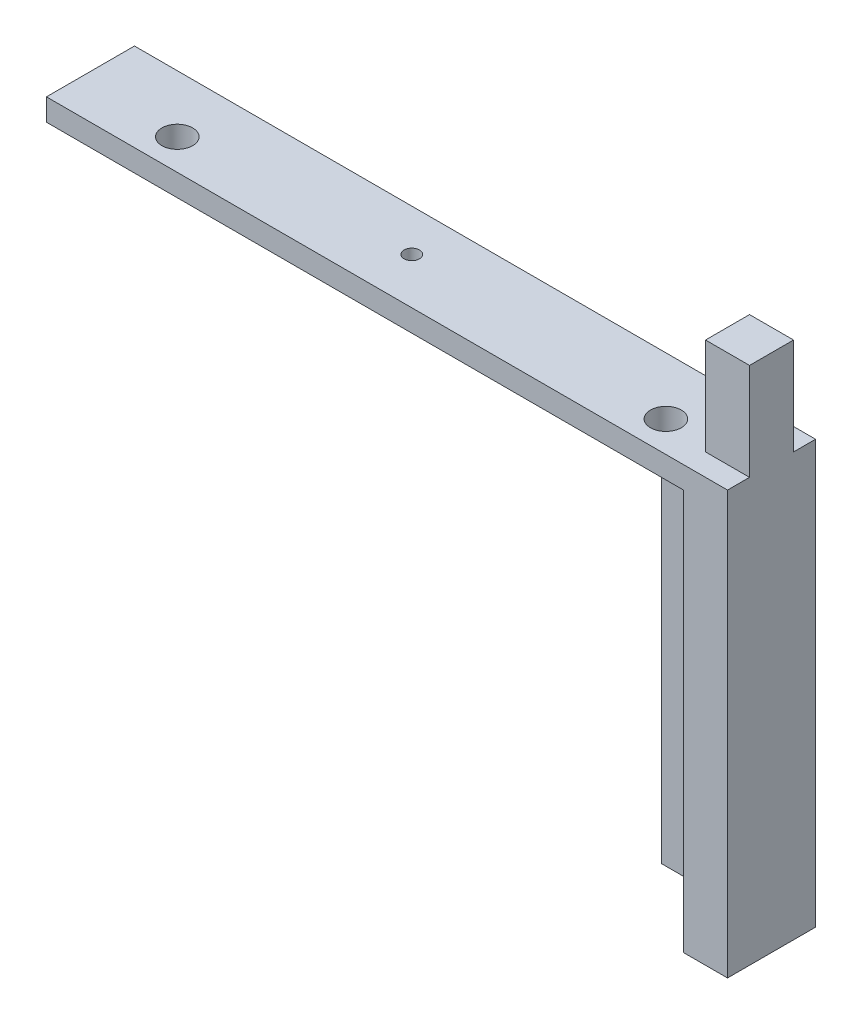
ISO-10303-21;
HEADER;
FILE_DESCRIPTION(('STEP AP214'),'2;1');
FILE_NAME('part.step','',(''),(''),'','','');
FILE_SCHEMA(('AUTOMOTIVE_DESIGN { 1 0 10303 214 1 1 1 1 }'));
ENDSEC;
DATA;
#1=APPLICATION_CONTEXT('core data for automotive mechanical design processes');
#2=APPLICATION_PROTOCOL_DEFINITION('international standard','automotive_design',2000,#1);
#3=PRODUCT_CONTEXT('',#1,'mechanical');
#4=PRODUCT('Part','Part','',(#3));
#5=PRODUCT_RELATED_PRODUCT_CATEGORY('part','',(#4));
#6=PRODUCT_DEFINITION_FORMATION('','',#4);
#7=PRODUCT_DEFINITION_CONTEXT('part definition',#1,'design');
#8=PRODUCT_DEFINITION('design','',#6,#7);
#9=PRODUCT_DEFINITION_SHAPE('','',#8);
#10=(LENGTH_UNIT() NAMED_UNIT(*) SI_UNIT(.MILLI.,.METRE.));
#11=(NAMED_UNIT(*) PLANE_ANGLE_UNIT() SI_UNIT($,.RADIAN.));
#12=(NAMED_UNIT(*) SI_UNIT($,.STERADIAN.) SOLID_ANGLE_UNIT());
#13=UNCERTAINTY_MEASURE_WITH_UNIT(LENGTH_MEASURE(1.E-05),#10,'distance_accuracy_value','');
#14=(GEOMETRIC_REPRESENTATION_CONTEXT(3) GLOBAL_UNCERTAINTY_ASSIGNED_CONTEXT((#13)) GLOBAL_UNIT_ASSIGNED_CONTEXT((#10,
#11,#12)) REPRESENTATION_CONTEXT('',''));
#15=CARTESIAN_POINT('',(0.,0.,0.));
#16=DIRECTION('',(0.,0.,1.));
#17=DIRECTION('',(1.,0.,0.));
#18=AXIS2_PLACEMENT_3D('',#15,#16,#17);
#19=CARTESIAN_POINT('',(0.,0.,10.));
#20=DIRECTION('',(1.,0.,0.));
#21=DIRECTION('',(0.,1.,0.));
#22=AXIS2_PLACEMENT_3D('',#19,#20,#21);
#23=PLANE('',#22);
#24=DIRECTION('',(0.,0.,1.));
#25=VECTOR('',#24,1.);
#26=CARTESIAN_POINT('',(0.,-9.31900447361045,0.));
#27=LINE('',#26,#25);
#28=CARTESIAN_POINT('',(0.,-9.31900447361045,-5.));
#29=VERTEX_POINT('',#28);
#30=CARTESIAN_POINT('',(0.,-9.31900447361045,0.));
#31=VERTEX_POINT('',#30);
#32=EDGE_CURVE('E58',#29,#31,#27,.T.);
#33=ORIENTED_EDGE('',*,*,#32,.F.);
#34=DIRECTION('',(0.,1.,0.));
#35=VECTOR('',#34,1.);
#36=CARTESIAN_POINT('',(0.,0.,-5.));
#37=LINE('',#36,#35);
#38=CARTESIAN_POINT('',(0.,-95.9999999999999,-5.00000000000001));
#39=VERTEX_POINT('',#38);
#40=EDGE_CURVE('E161',#39,#29,#37,.T.);
#41=ORIENTED_EDGE('',*,*,#40,.F.);
#42=DIRECTION('',(0.,0.,-1.));
#43=VECTOR('',#42,1.);
#44=CARTESIAN_POINT('',(0.,-95.9999999999999,0.));
#45=LINE('',#44,#43);
#46=CARTESIAN_POINT('',(0.,-95.9999999999999,0.));
#47=VERTEX_POINT('',#46);
#48=EDGE_CURVE('E162',#47,#39,#45,.T.);
#49=ORIENTED_EDGE('',*,*,#48,.F.);
#50=DIRECTION('',(0.,1.,0.));
#51=VECTOR('',#50,1.);
#52=CARTESIAN_POINT('',(0.,0.,0.));
#53=LINE('',#52,#51);
#54=EDGE_CURVE('E197',#47,#31,#53,.T.);
#55=ORIENTED_EDGE('',*,*,#54,.T.);
#56=EDGE_LOOP('',(#33,#41,#49,#55));
#57=FACE_BOUND('',#56,.T.);
#58=ADVANCED_FACE('F41',(#57),#23,.F.);
#59=CARTESIAN_POINT('',(0.,0.,0.));
#60=DIRECTION('',(0.,0.,1.));
#61=DIRECTION('',(1.,0.,0.));
#62=AXIS2_PLACEMENT_3D('',#59,#60,#61);
#63=PLANE('',#62);
#64=DIRECTION('',(1.,0.,0.));
#65=VECTOR('',#64,1.);
#66=CARTESIAN_POINT('',(0.,0.,0.));
#67=LINE('',#66,#65);
#68=CARTESIAN_POINT('',(20.,0.,0.));
#69=VERTEX_POINT('',#68);
#70=CARTESIAN_POINT('',(30.,0.,0.));
#71=VERTEX_POINT('',#70);
#72=EDGE_CURVE('E11',#69,#71,#67,.T.);
#73=ORIENTED_EDGE('',*,*,#72,.F.);
#74=DIRECTION('',(0.,-1.,0.));
#75=VECTOR('',#74,1.);
#76=CARTESIAN_POINT('',(20.,0.,0.));
#77=LINE('',#76,#75);
#78=CARTESIAN_POINT('',(20.,22.02,0.));
#79=VERTEX_POINT('',#78);
#80=EDGE_CURVE('E211',#79,#69,#77,.T.);
#81=ORIENTED_EDGE('',*,*,#80,.F.);
#82=DIRECTION('',(-1.,0.,0.));
#83=VECTOR('',#82,1.);
#84=CARTESIAN_POINT('',(20.,22.02,0.));
#85=LINE('',#84,#83);
#86=CARTESIAN_POINT('',(30.,22.02,0.));
#87=VERTEX_POINT('',#86);
#88=EDGE_CURVE('E221',#87,#79,#85,.T.);
#89=ORIENTED_EDGE('',*,*,#88,.F.);
#90=DIRECTION('',(0.,1.,0.));
#91=VECTOR('',#90,1.);
#92=CARTESIAN_POINT('',(30.,22.02,0.));
#93=LINE('',#92,#91);
#94=EDGE_CURVE('E219',#71,#87,#93,.T.);
#95=ORIENTED_EDGE('',*,*,#94,.F.);
#96=EDGE_LOOP('',(#73,#81,#89,#95));
#97=FACE_BOUND('',#96,.T.);
#98=ADVANCED_FACE('F294',(#97),#63,.F.);
#99=CARTESIAN_POINT('',(0.,0.,10.));
#100=DIRECTION('',(0.,-1.,0.));
#101=DIRECTION('',(0.,0.,-1.));
#102=AXIS2_PLACEMENT_3D('',#99,#100,#101);
#103=PLANE('',#102);
#104=CARTESIAN_POINT('',(9.00000000000002,0.,8.00000000000001));
#105=DIRECTION('',(0.,-1.,0.));
#106=DIRECTION('',(0.,0.,-1.));
#107=AXIS2_PLACEMENT_3D('',#104,#105,#106);
#108=CIRCLE('',#107,3.4999999999998);
#109=CARTESIAN_POINT('',(9.00000000000002,0.,4.50000000000021));
#110=VERTEX_POINT('',#109);
#111=EDGE_CURVE('E241',#110,#110,#108,.F.);
#112=ORIENTED_EDGE('',*,*,#111,.F.);
#113=EDGE_LOOP('',(#112));
#114=FACE_BOUND('',#113,.T.);
#115=CARTESIAN_POINT('',(-102.,0.,8.00000000000001));
#116=DIRECTION('',(0.,-1.,0.));
#117=DIRECTION('',(0.,0.,-1.));
#118=AXIS2_PLACEMENT_3D('',#115,#116,#117);
#119=CIRCLE('',#118,3.50000000000001);
#120=CARTESIAN_POINT('',(-102.,0.,4.5));
#121=VERTEX_POINT('',#120);
#122=EDGE_CURVE('E238',#121,#121,#119,.F.);
#123=ORIENTED_EDGE('',*,*,#122,.F.);
#124=EDGE_LOOP('',(#123));
#125=FACE_BOUND('',#124,.T.);
#126=CARTESIAN_POINT('',(-52.2204706117234,0.,4.50093124375004));
#127=DIRECTION('',(0.,-1.,0.));
#128=DIRECTION('',(0.,0.,-1.));
#129=AXIS2_PLACEMENT_3D('',#126,#127,#128);
#130=CIRCLE('',#129,1.75);
#131=CARTESIAN_POINT('',(-52.2204706117234,0.,2.75093124375003));
#132=VERTEX_POINT('',#131);
#133=EDGE_CURVE('E237',#132,#132,#130,.F.);
#134=ORIENTED_EDGE('',*,*,#133,.F.);
#135=EDGE_LOOP('',(#134));
#136=FACE_BOUND('',#135,.T.);
#137=DIRECTION('',(0.,0.,-1.));
#138=VECTOR('',#137,1.);
#139=CARTESIAN_POINT('',(20.,0.,10.));
#140=LINE('',#139,#138);
#141=CARTESIAN_POINT('',(20.,0.,10.));
#142=VERTEX_POINT('',#141);
#143=EDGE_CURVE('E215',#142,#69,#140,.T.);
#144=ORIENTED_EDGE('',*,*,#143,.T.);
#145=ORIENTED_EDGE('',*,*,#72,.T.);
#146=DIRECTION('',(0.,0.,1.));
#147=VECTOR('',#146,1.);
#148=CARTESIAN_POINT('',(30.,0.,-5.));
#149=LINE('',#148,#147);
#150=CARTESIAN_POINT('',(30.,0.,-5.));
#151=VERTEX_POINT('',#150);
#152=EDGE_CURVE('E203',#151,#71,#149,.T.);
#153=ORIENTED_EDGE('',*,*,#152,.F.);
#154=DIRECTION('',(1.,0.,0.));
#155=VECTOR('',#154,1.);
#156=CARTESIAN_POINT('',(0.,0.,-5.));
#157=LINE('',#156,#155);
#158=CARTESIAN_POINT('',(-124.720470611723,0.,-5.));
#159=VERTEX_POINT('',#158);
#160=EDGE_CURVE('E199',#159,#151,#157,.T.);
#161=ORIENTED_EDGE('',*,*,#160,.F.);
#162=DIRECTION('',(0.,0.,-1.));
#163=VECTOR('',#162,1.);
#164=CARTESIAN_POINT('',(-124.720470611723,0.,0.));
#165=LINE('',#164,#163);
#166=CARTESIAN_POINT('',(-124.720470611723,0.,15.));
#167=VERTEX_POINT('',#166);
#168=EDGE_CURVE('E156',#167,#159,#165,.T.);
#169=ORIENTED_EDGE('',*,*,#168,.F.);
#170=DIRECTION('',(-1.,0.,0.));
#171=VECTOR('',#170,1.);
#172=CARTESIAN_POINT('',(30.,0.,15.));
#173=LINE('',#172,#171);
#174=CARTESIAN_POINT('',(30.,0.,15.));
#175=VERTEX_POINT('',#174);
#176=EDGE_CURVE('E184',#175,#167,#173,.T.);
#177=ORIENTED_EDGE('',*,*,#176,.F.);
#178=DIRECTION('',(0.,0.,-1.));
#179=VECTOR('',#178,1.);
#180=CARTESIAN_POINT('',(30.,0.,15.));
#181=LINE('',#180,#179);
#182=CARTESIAN_POINT('',(30.,0.,10.));
#183=VERTEX_POINT('',#182);
#184=EDGE_CURVE('E193',#175,#183,#181,.T.);
#185=ORIENTED_EDGE('',*,*,#184,.T.);
#186=DIRECTION('',(-1.,0.,0.));
#187=VECTOR('',#186,1.);
#188=CARTESIAN_POINT('',(30.,0.,10.));
#189=LINE('',#188,#187);
#190=EDGE_CURVE('E66',#183,#142,#189,.T.);
#191=ORIENTED_EDGE('',*,*,#190,.T.);
#192=EDGE_LOOP('',(#144,#145,#153,#161,#169,#177,#185,#191));
#193=FACE_BOUND('',#192,.T.);
#194=ADVANCED_FACE('F43',(#114,#125,#136,#193),#103,.F.);
#195=CARTESIAN_POINT('',(0.,-5.,10.));
#196=DIRECTION('',(0.,1.,0.));
#197=DIRECTION('',(0.,0.,1.));
#198=AXIS2_PLACEMENT_3D('',#195,#196,#197);
#199=PLANE('',#198);
#200=CARTESIAN_POINT('',(9.00000000000002,-5.,8.00000000000001));
#201=DIRECTION('',(0.,1.,0.));
#202=DIRECTION('',(0.,0.,1.));
#203=AXIS2_PLACEMENT_3D('',#200,#201,#202);
#204=CIRCLE('',#203,3.4999999999998);
#205=CARTESIAN_POINT('',(9.00000000000002,-5.,11.4999999999998));
#206=VERTEX_POINT('',#205);
#207=EDGE_CURVE('E45',#206,#206,#204,.F.);
#208=ORIENTED_EDGE('',*,*,#207,.F.);
#209=EDGE_LOOP('',(#208));
#210=FACE_BOUND('',#209,.T.);
#211=CARTESIAN_POINT('',(-102.,-5.,8.00000000000001));
#212=DIRECTION('',(0.,1.,0.));
#213=DIRECTION('',(0.,0.,1.));
#214=AXIS2_PLACEMENT_3D('',#211,#212,#213);
#215=CIRCLE('',#214,3.50000000000001);
#216=CARTESIAN_POINT('',(-102.,-5.,11.5));
#217=VERTEX_POINT('',#216);
#218=EDGE_CURVE('E239',#217,#217,#215,.F.);
#219=ORIENTED_EDGE('',*,*,#218,.F.);
#220=EDGE_LOOP('',(#219));
#221=FACE_BOUND('',#220,.T.);
#222=CARTESIAN_POINT('',(-52.2204706117234,-5.,4.50093124375004));
#223=DIRECTION('',(0.,1.,0.));
#224=DIRECTION('',(0.,0.,1.));
#225=AXIS2_PLACEMENT_3D('',#222,#223,#224);
#226=CIRCLE('',#225,1.75);
#227=CARTESIAN_POINT('',(-52.2204706117234,-5.,6.25093124375004));
#228=VERTEX_POINT('',#227);
#229=EDGE_CURVE('E235',#228,#228,#226,.F.);
#230=ORIENTED_EDGE('',*,*,#229,.F.);
#231=EDGE_LOOP('',(#230));
#232=FACE_BOUND('',#231,.T.);
#233=DIRECTION('',(1.,0.,0.));
#234=VECTOR('',#233,1.);
#235=CARTESIAN_POINT('',(0.,-5.,0.));
#236=LINE('',#235,#234);
#237=CARTESIAN_POINT('',(-124.720470611723,-5.00000000000002,0.));
#238=VERTEX_POINT('',#237);
#239=CARTESIAN_POINT('',(20.,-5.,0.));
#240=VERTEX_POINT('',#239);
#241=EDGE_CURVE('E207',#238,#240,#236,.T.);
#242=ORIENTED_EDGE('',*,*,#241,.T.);
#243=DIRECTION('',(0.,0.,-1.));
#244=VECTOR('',#243,1.);
#245=CARTESIAN_POINT('',(20.,-5.,10.));
#246=LINE('',#245,#244);
#247=CARTESIAN_POINT('',(20.,-5.,15.));
#248=VERTEX_POINT('',#247);
#249=EDGE_CURVE('E50',#248,#240,#246,.T.);
#250=ORIENTED_EDGE('',*,*,#249,.F.);
#251=DIRECTION('',(1.,0.,0.));
#252=VECTOR('',#251,1.);
#253=CARTESIAN_POINT('',(0.,-5.,15.));
#254=LINE('',#253,#252);
#255=CARTESIAN_POINT('',(-124.720470611723,-5.00000000000002,15.));
#256=VERTEX_POINT('',#255);
#257=EDGE_CURVE('E186',#256,#248,#254,.T.);
#258=ORIENTED_EDGE('',*,*,#257,.F.);
#259=DIRECTION('',(0.,0.,1.));
#260=VECTOR('',#259,1.);
#261=CARTESIAN_POINT('',(-124.720470611723,-5.00000000000002,0.));
#262=LINE('',#261,#260);
#263=EDGE_CURVE('E261',#238,#256,#262,.T.);
#264=ORIENTED_EDGE('',*,*,#263,.F.);
#265=EDGE_LOOP('',(#242,#250,#258,#264));
#266=FACE_BOUND('',#265,.T.);
#267=ADVANCED_FACE('F273',(#210,#221,#232,#266),#199,.F.);
#268=CARTESIAN_POINT('',(20.,-5.,10.));
#269=DIRECTION('',(1.,0.,0.));
#270=DIRECTION('',(0.,0.,-1.));
#271=AXIS2_PLACEMENT_3D('',#268,#269,#270);
#272=PLANE('',#271);
#273=DIRECTION('',(0.,-1.,0.));
#274=VECTOR('',#273,1.);
#275=CARTESIAN_POINT('',(20.,-5.,0.));
#276=LINE('',#275,#274);
#277=CARTESIAN_POINT('',(20.,-95.9999999999999,0.));
#278=VERTEX_POINT('',#277);
#279=EDGE_CURVE('E217',#240,#278,#276,.T.);
#280=ORIENTED_EDGE('',*,*,#279,.T.);
#281=DIRECTION('',(0.,0.,-1.));
#282=VECTOR('',#281,1.);
#283=CARTESIAN_POINT('',(20.,-95.9999999999999,15.));
#284=LINE('',#283,#282);
#285=CARTESIAN_POINT('',(20.,-95.9999999999999,15.));
#286=VERTEX_POINT('',#285);
#287=EDGE_CURVE('E173',#286,#278,#284,.T.);
#288=ORIENTED_EDGE('',*,*,#287,.F.);
#289=DIRECTION('',(0.,-1.,0.));
#290=VECTOR('',#289,1.);
#291=CARTESIAN_POINT('',(20.,-5.,15.));
#292=LINE('',#291,#290);
#293=EDGE_CURVE('E189',#248,#286,#292,.T.);
#294=ORIENTED_EDGE('',*,*,#293,.F.);
#295=ORIENTED_EDGE('',*,*,#249,.T.);
#296=EDGE_LOOP('',(#280,#288,#294,#295));
#297=FACE_BOUND('',#296,.T.);
#298=ADVANCED_FACE('F280',(#297),#272,.F.);
#299=CARTESIAN_POINT('',(30.,22.02,10.));
#300=DIRECTION('',(-1.,0.,0.));
#301=DIRECTION('',(0.,0.,1.));
#302=AXIS2_PLACEMENT_3D('',#299,#300,#301);
#303=PLANE('',#302);
#304=DIRECTION('',(0.,1.,0.));
#305=VECTOR('',#304,1.);
#306=CARTESIAN_POINT('',(30.,-25.,15.));
#307=LINE('',#306,#305);
#308=CARTESIAN_POINT('',(30.,-95.9999999999999,15.));
#309=VERTEX_POINT('',#308);
#310=EDGE_CURVE('E191',#309,#175,#307,.T.);
#311=ORIENTED_EDGE('',*,*,#310,.F.);
#312=DIRECTION('',(0.,0.,1.));
#313=VECTOR('',#312,1.);
#314=CARTESIAN_POINT('',(30.,-95.9999999999999,-5.));
#315=LINE('',#314,#313);
#316=CARTESIAN_POINT('',(30.,-95.9999999999999,-5.));
#317=VERTEX_POINT('',#316);
#318=EDGE_CURVE('E174',#317,#309,#315,.T.);
#319=ORIENTED_EDGE('',*,*,#318,.F.);
#320=DIRECTION('',(0.,-1.,0.));
#321=VECTOR('',#320,1.);
#322=CARTESIAN_POINT('',(30.,0.,-5.));
#323=LINE('',#322,#321);
#324=EDGE_CURVE('E201',#151,#317,#323,.T.);
#325=ORIENTED_EDGE('',*,*,#324,.F.);
#326=ORIENTED_EDGE('',*,*,#152,.T.);
#327=ORIENTED_EDGE('',*,*,#94,.T.);
#328=DIRECTION('',(0.,0.,-1.));
#329=VECTOR('',#328,1.);
#330=CARTESIAN_POINT('',(30.,22.02,10.));
#331=LINE('',#330,#329);
#332=CARTESIAN_POINT('',(30.,22.02,10.));
#333=VERTEX_POINT('',#332);
#334=EDGE_CURVE('E230',#333,#87,#331,.T.);
#335=ORIENTED_EDGE('',*,*,#334,.F.);
#336=DIRECTION('',(0.,1.,0.));
#337=VECTOR('',#336,1.);
#338=CARTESIAN_POINT('',(30.,22.02,10.));
#339=LINE('',#338,#337);
#340=EDGE_CURVE('E208',#183,#333,#339,.T.);
#341=ORIENTED_EDGE('',*,*,#340,.F.);
#342=ORIENTED_EDGE('',*,*,#184,.F.);
#343=EDGE_LOOP('',(#311,#319,#325,#326,#327,#335,#341,#342));
#344=FACE_BOUND('',#343,.T.);
#345=ADVANCED_FACE('F288',(#344),#303,.F.);
#346=CARTESIAN_POINT('',(20.,22.02,10.));
#347=DIRECTION('',(0.,-1.,0.));
#348=DIRECTION('',(0.,0.,-1.));
#349=AXIS2_PLACEMENT_3D('',#346,#347,#348);
#350=PLANE('',#349);
#351=ORIENTED_EDGE('',*,*,#88,.T.);
#352=DIRECTION('',(0.,0.,-1.));
#353=VECTOR('',#352,1.);
#354=CARTESIAN_POINT('',(20.,22.02,10.));
#355=LINE('',#354,#353);
#356=CARTESIAN_POINT('',(20.,22.02,10.));
#357=VERTEX_POINT('',#356);
#358=EDGE_CURVE('E227',#357,#79,#355,.T.);
#359=ORIENTED_EDGE('',*,*,#358,.F.);
#360=DIRECTION('',(-1.,0.,0.));
#361=VECTOR('',#360,1.);
#362=CARTESIAN_POINT('',(20.,22.02,10.));
#363=LINE('',#362,#361);
#364=EDGE_CURVE('E210',#333,#357,#363,.T.);
#365=ORIENTED_EDGE('',*,*,#364,.F.);
#366=ORIENTED_EDGE('',*,*,#334,.T.);
#367=EDGE_LOOP('',(#351,#359,#365,#366));
#368=FACE_BOUND('',#367,.T.);
#369=ADVANCED_FACE('F310',(#368),#350,.F.);
#370=CARTESIAN_POINT('',(20.,0.,10.));
#371=DIRECTION('',(1.,0.,0.));
#372=DIRECTION('',(0.,0.,-1.));
#373=AXIS2_PLACEMENT_3D('',#370,#371,#372);
#374=PLANE('',#373);
#375=ORIENTED_EDGE('',*,*,#80,.T.);
#376=ORIENTED_EDGE('',*,*,#143,.F.);
#377=DIRECTION('',(0.,-1.,0.));
#378=VECTOR('',#377,1.);
#379=CARTESIAN_POINT('',(20.,0.,10.));
#380=LINE('',#379,#378);
#381=EDGE_CURVE('E213',#357,#142,#380,.T.);
#382=ORIENTED_EDGE('',*,*,#381,.F.);
#383=ORIENTED_EDGE('',*,*,#358,.T.);
#384=EDGE_LOOP('',(#375,#376,#382,#383));
#385=FACE_BOUND('',#384,.T.);
#386=ADVANCED_FACE('F313',(#385),#374,.F.);
#387=CARTESIAN_POINT('',(0.,0.,10.));
#388=DIRECTION('',(0.,0.,1.));
#389=DIRECTION('',(1.,0.,0.));
#390=AXIS2_PLACEMENT_3D('',#387,#388,#389);
#391=PLANE('',#390);
#392=ORIENTED_EDGE('',*,*,#190,.F.);
#393=ORIENTED_EDGE('',*,*,#340,.T.);
#394=ORIENTED_EDGE('',*,*,#364,.T.);
#395=ORIENTED_EDGE('',*,*,#381,.T.);
#396=EDGE_LOOP('',(#392,#393,#394,#395));
#397=FACE_BOUND('',#396,.T.);
#398=ADVANCED_FACE('F316',(#397),#391,.T.);
#399=CARTESIAN_POINT('',(0.,0.,0.));
#400=DIRECTION('',(0.,0.,1.));
#401=DIRECTION('',(1.,0.,0.));
#402=AXIS2_PLACEMENT_3D('',#399,#400,#401);
#403=PLANE('',#402);
#404=CARTESIAN_POINT('',(13.0000000000001,-15.0000000000002,0.));
#405=DIRECTION('',(0.,0.,1.));
#406=DIRECTION('',(1.,0.,0.));
#407=AXIS2_PLACEMENT_3D('',#404,#405,#406);
#408=CIRCLE('',#407,3.25);
#409=CARTESIAN_POINT('',(16.2500000000001,-15.0000000000002,0.));
#410=VERTEX_POINT('',#409);
#411=EDGE_CURVE('E257',#410,#410,#408,.T.);
#412=ORIENTED_EDGE('',*,*,#411,.F.);
#413=EDGE_LOOP('',(#412));
#414=FACE_BOUND('',#413,.T.);
#415=ORIENTED_EDGE('',*,*,#279,.F.);
#416=ORIENTED_EDGE('',*,*,#241,.F.);
#417=DIRECTION('',(0.,1.,0.));
#418=VECTOR('',#417,1.);
#419=CARTESIAN_POINT('',(-124.720470611723,0.,0.));
#420=LINE('',#419,#418);
#421=CARTESIAN_POINT('',(-124.720470611723,-9.31900447361046,0.));
#422=VERTEX_POINT('',#421);
#423=EDGE_CURVE('E148',#422,#238,#420,.T.);
#424=ORIENTED_EDGE('',*,*,#423,.F.);
#425=DIRECTION('',(1.,0.,0.));
#426=VECTOR('',#425,1.);
#427=CARTESIAN_POINT('',(-124.720470611723,-9.31900447361046,0.));
#428=LINE('',#427,#426);
#429=EDGE_CURVE('E144',#422,#31,#428,.T.);
#430=ORIENTED_EDGE('',*,*,#429,.T.);
#431=ORIENTED_EDGE('',*,*,#54,.F.);
#432=DIRECTION('',(-1.,0.,0.));
#433=VECTOR('',#432,1.);
#434=CARTESIAN_POINT('',(20.0000000000002,-95.9999999999999,0.));
#435=LINE('',#434,#433);
#436=EDGE_CURVE('E177',#278,#47,#435,.T.);
#437=ORIENTED_EDGE('',*,*,#436,.F.);
#438=EDGE_LOOP('',(#415,#416,#424,#430,#431,#437));
#439=FACE_BOUND('',#438,.T.);
#440=ADVANCED_FACE('F268',(#414,#439),#403,.T.);
#441=CARTESIAN_POINT('',(0.,0.,-5.));
#442=DIRECTION('',(0.,0.,1.));
#443=DIRECTION('',(1.,0.,0.));
#444=AXIS2_PLACEMENT_3D('',#441,#442,#443);
#445=PLANE('',#444);
#446=CARTESIAN_POINT('',(13.0000000000001,-15.0000000000002,-5.));
#447=DIRECTION('',(0.,0.,-1.));
#448=DIRECTION('',(-1.,0.,0.));
#449=AXIS2_PLACEMENT_3D('',#446,#447,#448);
#450=CIRCLE('',#449,3.25);
#451=CARTESIAN_POINT('',(9.75000000000005,-15.0000000000002,-5.));
#452=VERTEX_POINT('',#451);
#453=EDGE_CURVE('E254',#452,#452,#450,.T.);
#454=ORIENTED_EDGE('',*,*,#453,.F.);
#455=EDGE_LOOP('',(#454));
#456=FACE_BOUND('',#455,.T.);
#457=ORIENTED_EDGE('',*,*,#40,.T.);
#458=DIRECTION('',(1.,0.,0.));
#459=VECTOR('',#458,1.);
#460=CARTESIAN_POINT('',(-124.720470611723,-9.31900447361046,-5.));
#461=LINE('',#460,#459);
#462=CARTESIAN_POINT('',(-124.720470611723,-9.31900447361046,-5.));
#463=VERTEX_POINT('',#462);
#464=EDGE_CURVE('E142',#463,#29,#461,.T.);
#465=ORIENTED_EDGE('',*,*,#464,.F.);
#466=DIRECTION('',(0.,-1.,0.));
#467=VECTOR('',#466,1.);
#468=CARTESIAN_POINT('',(-124.720470611723,0.,-5.));
#469=LINE('',#468,#467);
#470=EDGE_CURVE('E149',#159,#463,#469,.T.);
#471=ORIENTED_EDGE('',*,*,#470,.F.);
#472=ORIENTED_EDGE('',*,*,#160,.T.);
#473=ORIENTED_EDGE('',*,*,#324,.T.);
#474=DIRECTION('',(1.,0.,0.));
#475=VECTOR('',#474,1.);
#476=CARTESIAN_POINT('',(0.,-95.9999999999999,-5.));
#477=LINE('',#476,#475);
#478=EDGE_CURVE('E165',#39,#317,#477,.T.);
#479=ORIENTED_EDGE('',*,*,#478,.F.);
#480=EDGE_LOOP('',(#457,#465,#471,#472,#473,#479));
#481=FACE_BOUND('',#480,.T.);
#482=ADVANCED_FACE('F159',(#456,#481),#445,.F.);
#483=CARTESIAN_POINT('',(0.,0.,15.));
#484=DIRECTION('',(0.,0.,1.));
#485=DIRECTION('',(1.,0.,0.));
#486=AXIS2_PLACEMENT_3D('',#483,#484,#485);
#487=PLANE('',#486);
#488=ORIENTED_EDGE('',*,*,#176,.T.);
#489=DIRECTION('',(0.,1.,0.));
#490=VECTOR('',#489,1.);
#491=CARTESIAN_POINT('',(-124.720470611723,0.,15.));
#492=LINE('',#491,#490);
#493=EDGE_CURVE('E264',#256,#167,#492,.T.);
#494=ORIENTED_EDGE('',*,*,#493,.F.);
#495=ORIENTED_EDGE('',*,*,#257,.T.);
#496=ORIENTED_EDGE('',*,*,#293,.T.);
#497=DIRECTION('',(-1.,0.,0.));
#498=VECTOR('',#497,1.);
#499=CARTESIAN_POINT('',(30.,-95.9999999999999,15.));
#500=LINE('',#499,#498);
#501=EDGE_CURVE('E170',#309,#286,#500,.T.);
#502=ORIENTED_EDGE('',*,*,#501,.F.);
#503=ORIENTED_EDGE('',*,*,#310,.T.);
#504=EDGE_LOOP('',(#488,#494,#495,#496,#502,#503));
#505=FACE_BOUND('',#504,.T.);
#506=ADVANCED_FACE('F276',(#505),#487,.T.);
#507=CARTESIAN_POINT('',(30.,-95.9999999999999,9.99999999999999));
#508=DIRECTION('',(0.,-1.,0.));
#509=DIRECTION('',(1.,0.,0.));
#510=AXIS2_PLACEMENT_3D('',#507,#508,#509);
#511=PLANE('',#510);
#512=ORIENTED_EDGE('',*,*,#48,.T.);
#513=ORIENTED_EDGE('',*,*,#478,.T.);
#514=ORIENTED_EDGE('',*,*,#318,.T.);
#515=ORIENTED_EDGE('',*,*,#501,.T.);
#516=ORIENTED_EDGE('',*,*,#287,.T.);
#517=ORIENTED_EDGE('',*,*,#436,.T.);
#518=EDGE_LOOP('',(#512,#513,#514,#515,#516,#517));
#519=FACE_BOUND('',#518,.T.);
#520=ADVANCED_FACE('F282',(#519),#511,.T.);
#521=CARTESIAN_POINT('',(-124.720470611723,-9.31900447361046,0.));
#522=DIRECTION('',(0.,1.,0.));
#523=DIRECTION('',(-1.,0.,0.));
#524=AXIS2_PLACEMENT_3D('',#521,#522,#523);
#525=PLANE('',#524);
#526=ORIENTED_EDGE('',*,*,#32,.T.);
#527=ORIENTED_EDGE('',*,*,#429,.F.);
#528=DIRECTION('',(0.,0.,1.));
#529=VECTOR('',#528,1.);
#530=CARTESIAN_POINT('',(-124.720470611723,-9.31900447361046,0.));
#531=LINE('',#530,#529);
#532=EDGE_CURVE('E138',#463,#422,#531,.T.);
#533=ORIENTED_EDGE('',*,*,#532,.F.);
#534=ORIENTED_EDGE('',*,*,#464,.T.);
#535=EDGE_LOOP('',(#526,#527,#533,#534));
#536=FACE_BOUND('',#535,.T.);
#537=ADVANCED_FACE('F140',(#536),#525,.F.);
#538=CARTESIAN_POINT('',(-124.720470611723,0.,0.));
#539=DIRECTION('',(-1.,0.,0.));
#540=DIRECTION('',(0.,-1.,0.));
#541=AXIS2_PLACEMENT_3D('',#538,#539,#540);
#542=PLANE('',#541);
#543=ORIENTED_EDGE('',*,*,#470,.T.);
#544=ORIENTED_EDGE('',*,*,#532,.T.);
#545=ORIENTED_EDGE('',*,*,#423,.T.);
#546=ORIENTED_EDGE('',*,*,#263,.T.);
#547=ORIENTED_EDGE('',*,*,#493,.T.);
#548=ORIENTED_EDGE('',*,*,#168,.T.);
#549=EDGE_LOOP('',(#543,#544,#545,#546,#547,#548));
#550=FACE_BOUND('',#549,.T.);
#551=ADVANCED_FACE('F153',(#550),#542,.T.);
#552=CARTESIAN_POINT('',(13.0000000000001,-15.0000000000002,9.99999999999999));
#553=DIRECTION('',(0.,0.,-1.));
#554=DIRECTION('',(-1.,0.,0.));
#555=AXIS2_PLACEMENT_3D('',#552,#553,#554);
#556=CYLINDRICAL_SURFACE('',#555,3.25);
#557=ORIENTED_EDGE('',*,*,#411,.T.);
#558=EDGE_LOOP('',(#557));
#559=FACE_BOUND('',#558,.T.);
#560=ORIENTED_EDGE('',*,*,#453,.T.);
#561=EDGE_LOOP('',(#560));
#562=FACE_BOUND('',#561,.T.);
#563=ADVANCED_FACE('F333',(#559,#562),#556,.F.);
#564=CARTESIAN_POINT('',(-52.2204706117234,8.,4.50093124375004));
#565=DIRECTION('',(0.,-1.,0.));
#566=DIRECTION('',(0.,0.,-1.));
#567=AXIS2_PLACEMENT_3D('',#564,#565,#566);
#568=CYLINDRICAL_SURFACE('',#567,1.75);
#569=ORIENTED_EDGE('',*,*,#229,.T.);
#570=EDGE_LOOP('',(#569));
#571=FACE_BOUND('',#570,.T.);
#572=ORIENTED_EDGE('',*,*,#133,.T.);
#573=EDGE_LOOP('',(#572));
#574=FACE_BOUND('',#573,.T.);
#575=ADVANCED_FACE('F336',(#571,#574),#568,.F.);
#576=CARTESIAN_POINT('',(-102.,8.,8.00000000000001));
#577=DIRECTION('',(0.,-1.,0.));
#578=DIRECTION('',(0.,0.,-1.));
#579=AXIS2_PLACEMENT_3D('',#576,#577,#578);
#580=CYLINDRICAL_SURFACE('',#579,3.50000000000001);
#581=ORIENTED_EDGE('',*,*,#218,.T.);
#582=EDGE_LOOP('',(#581));
#583=FACE_BOUND('',#582,.T.);
#584=ORIENTED_EDGE('',*,*,#122,.T.);
#585=EDGE_LOOP('',(#584));
#586=FACE_BOUND('',#585,.T.);
#587=ADVANCED_FACE('F340',(#583,#586),#580,.F.);
#588=CARTESIAN_POINT('',(9.00000000000002,3.99999999999999,8.00000000000001));
#589=DIRECTION('',(0.,-1.,0.));
#590=DIRECTION('',(0.,0.,-1.));
#591=AXIS2_PLACEMENT_3D('',#588,#589,#590);
#592=CYLINDRICAL_SURFACE('',#591,3.4999999999998);
#593=ORIENTED_EDGE('',*,*,#207,.T.);
#594=EDGE_LOOP('',(#593));
#595=FACE_BOUND('',#594,.T.);
#596=ORIENTED_EDGE('',*,*,#111,.T.);
#597=EDGE_LOOP('',(#596));
#598=FACE_BOUND('',#597,.T.);
#599=ADVANCED_FACE('F344',(#595,#598),#592,.F.);
#600=CLOSED_SHELL('',(#58,#98,#194,#267,#298,#345,#369,#386,#398,#440,#482,#506,#520,#537,#551,
#563,#575,#587,#599));
#601=MANIFOLD_SOLID_BREP('B2',#600);
#602=ADVANCED_BREP_SHAPE_REPRESENTATION('',(#18,#601),#14);
#603=SHAPE_DEFINITION_REPRESENTATION(#9,#602);
ENDSEC;
END-ISO-10303-21;
